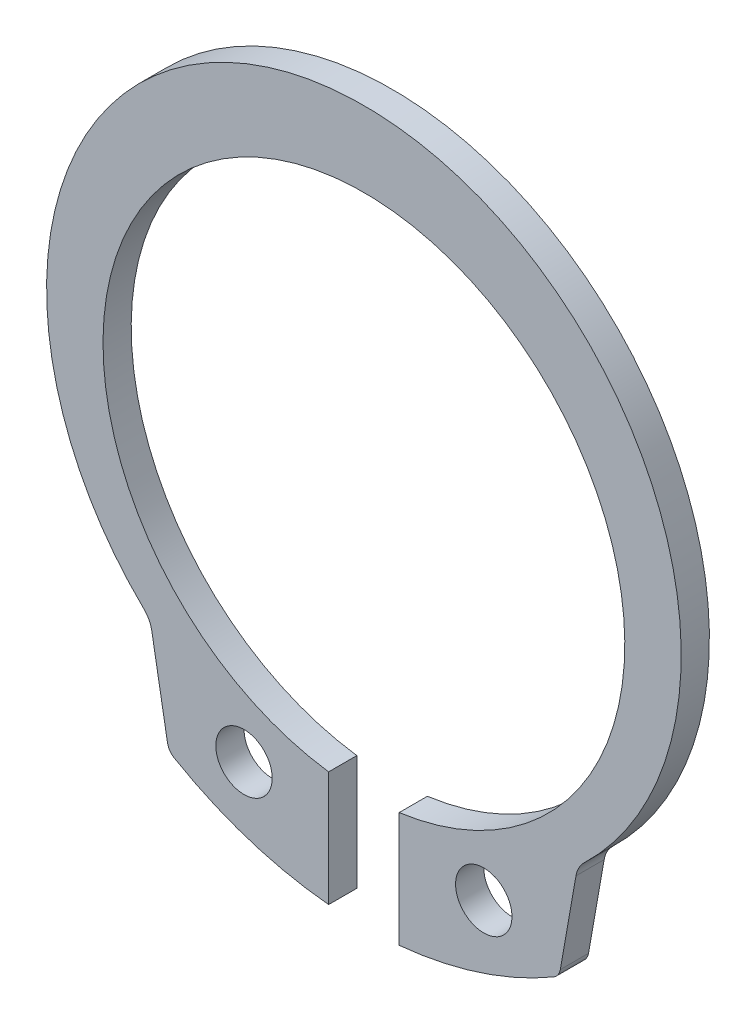
ISO-10303-21;
HEADER;
FILE_DESCRIPTION(('STEP AP214'),'2;1');
FILE_NAME('part.step','',(''),(''),'','','');
FILE_SCHEMA(('AUTOMOTIVE_DESIGN { 1 0 10303 214 1 1 1 1 }'));
ENDSEC;
DATA;
#1=APPLICATION_CONTEXT('core data for automotive mechanical design processes');
#2=APPLICATION_PROTOCOL_DEFINITION('international standard','automotive_design',2000,#1);
#3=PRODUCT_CONTEXT('',#1,'mechanical');
#4=PRODUCT('Part','Part','',(#3));
#5=PRODUCT_RELATED_PRODUCT_CATEGORY('part','',(#4));
#6=PRODUCT_DEFINITION_FORMATION('','',#4);
#7=PRODUCT_DEFINITION_CONTEXT('part definition',#1,'design');
#8=PRODUCT_DEFINITION('design','',#6,#7);
#9=PRODUCT_DEFINITION_SHAPE('','',#8);
#10=(LENGTH_UNIT() NAMED_UNIT(*) SI_UNIT(.MILLI.,.METRE.));
#11=(NAMED_UNIT(*) PLANE_ANGLE_UNIT() SI_UNIT($,.RADIAN.));
#12=(NAMED_UNIT(*) SI_UNIT($,.STERADIAN.) SOLID_ANGLE_UNIT());
#13=UNCERTAINTY_MEASURE_WITH_UNIT(LENGTH_MEASURE(1.E-05),#10,'distance_accuracy_value','');
#14=(GEOMETRIC_REPRESENTATION_CONTEXT(3) GLOBAL_UNCERTAINTY_ASSIGNED_CONTEXT((#13)) GLOBAL_UNIT_ASSIGNED_CONTEXT((#10,
#11,#12)) REPRESENTATION_CONTEXT('',''));
#15=CARTESIAN_POINT('',(0.,0.,0.));
#16=DIRECTION('',(0.,0.,1.));
#17=DIRECTION('',(1.,0.,0.));
#18=AXIS2_PLACEMENT_3D('',#15,#16,#17);
#19=CARTESIAN_POINT('',(0.,-0.67,-1.));
#20=DIRECTION('',(0.,0.,1.));
#21=DIRECTION('',(1.,0.,0.));
#22=AXIS2_PLACEMENT_3D('',#19,#20,#21);
#23=CYLINDRICAL_SURFACE('',#22,13.3);
#24=CARTESIAN_POINT('',(0.,-0.67,-1.));
#25=DIRECTION('',(0.,0.,1.));
#26=DIRECTION('',(-1.,0.,0.));
#27=AXIS2_PLACEMENT_3D('',#24,#25,#26);
#28=CIRCLE('',#27,13.3);
#29=CARTESIAN_POINT('',(1.25,-13.9111291059335,-1.));
#30=VERTEX_POINT('',#29);
#31=CARTESIAN_POINT('',(6.72288210242388,-12.1457507918615,-1.));
#32=VERTEX_POINT('',#31);
#33=EDGE_CURVE('E174',#30,#32,#28,.T.);
#34=ORIENTED_EDGE('',*,*,#33,.T.);
#35=DIRECTION('',(0.,0.,1.));
#36=VECTOR('',#35,1.);
#37=CARTESIAN_POINT('',(6.72288210242388,-12.1457507918615,-1.));
#38=LINE('',#37,#36);
#39=CARTESIAN_POINT('',(6.72288210242388,-12.1457507918615,0.));
#40=VERTEX_POINT('',#39);
#41=EDGE_CURVE('E192',#32,#40,#38,.T.);
#42=ORIENTED_EDGE('',*,*,#41,.T.);
#43=CARTESIAN_POINT('',(0.,-0.67,0.));
#44=DIRECTION('',(0.,0.,1.));
#45=DIRECTION('',(-1.,0.,0.));
#46=AXIS2_PLACEMENT_3D('',#43,#44,#45);
#47=CIRCLE('',#46,13.3);
#48=CARTESIAN_POINT('',(1.25,-13.9111291059335,0.));
#49=VERTEX_POINT('',#48);
#50=EDGE_CURVE('E154',#49,#40,#47,.T.);
#51=ORIENTED_EDGE('',*,*,#50,.F.);
#52=DIRECTION('',(0.,0.,1.));
#53=VECTOR('',#52,1.);
#54=CARTESIAN_POINT('',(1.25,-13.9111291059335,-1.));
#55=LINE('',#54,#53);
#56=EDGE_CURVE('E175',#30,#49,#55,.T.);
#57=ORIENTED_EDGE('',*,*,#56,.F.);
#58=EDGE_LOOP('',(#34,#42,#51,#57));
#59=FACE_BOUND('',#58,.T.);
#60=ADVANCED_FACE('F33',(#59),#23,.T.);
#61=CARTESIAN_POINT('',(1.25,-9.83515138991168,-1.));
#62=DIRECTION('',(-1.,0.,0.));
#63=DIRECTION('',(0.,-1.,0.));
#64=AXIS2_PLACEMENT_3D('',#61,#62,#63);
#65=PLANE('',#64);
#66=DIRECTION('',(0.,-1.,0.));
#67=VECTOR('',#66,1.);
#68=CARTESIAN_POINT('',(1.25,-9.83515138991168,0.));
#69=LINE('',#68,#67);
#70=CARTESIAN_POINT('',(1.25,-9.83515138991168,0.));
#71=VERTEX_POINT('',#70);
#72=EDGE_CURVE('E171',#71,#49,#69,.T.);
#73=ORIENTED_EDGE('',*,*,#72,.F.);
#74=DIRECTION('',(0.,0.,1.));
#75=VECTOR('',#74,1.);
#76=CARTESIAN_POINT('',(1.25,-9.83515138991168,-1.));
#77=LINE('',#76,#75);
#78=CARTESIAN_POINT('',(1.25,-9.83515138991168,-1.));
#79=VERTEX_POINT('',#78);
#80=EDGE_CURVE('E178',#79,#71,#77,.T.);
#81=ORIENTED_EDGE('',*,*,#80,.F.);
#82=DIRECTION('',(0.,-1.,0.));
#83=VECTOR('',#82,1.);
#84=CARTESIAN_POINT('',(1.25,-9.83515138991168,-1.));
#85=LINE('',#84,#83);
#86=EDGE_CURVE('E141',#79,#30,#85,.T.);
#87=ORIENTED_EDGE('',*,*,#86,.T.);
#88=ORIENTED_EDGE('',*,*,#56,.T.);
#89=EDGE_LOOP('',(#73,#81,#87,#88));
#90=FACE_BOUND('',#89,.T.);
#91=ADVANCED_FACE('F273',(#90),#65,.T.);
#92=CARTESIAN_POINT('',(0.,-0.67,-1.));
#93=DIRECTION('',(0.,0.,1.));
#94=DIRECTION('',(1.,0.,0.));
#95=AXIS2_PLACEMENT_3D('',#92,#93,#94);
#96=CYLINDRICAL_SURFACE('',#95,9.25);
#97=CARTESIAN_POINT('',(0.,-0.67,0.));
#98=DIRECTION('',(0.,0.,-1.));
#99=DIRECTION('',(1.,0.,0.));
#100=AXIS2_PLACEMENT_3D('',#97,#98,#99);
#101=CIRCLE('',#100,9.25);
#102=CARTESIAN_POINT('',(-1.25000000000001,-9.83515138991168,0.));
#103=VERTEX_POINT('',#102);
#104=EDGE_CURVE('E168',#103,#71,#101,.T.);
#105=ORIENTED_EDGE('',*,*,#104,.F.);
#106=DIRECTION('',(0.,0.,1.));
#107=VECTOR('',#106,1.);
#108=CARTESIAN_POINT('',(-1.25000000000001,-9.83515138991168,-1.));
#109=LINE('',#108,#107);
#110=CARTESIAN_POINT('',(-1.25000000000001,-9.83515138991168,-1.));
#111=VERTEX_POINT('',#110);
#112=EDGE_CURVE('E140',#111,#103,#109,.T.);
#113=ORIENTED_EDGE('',*,*,#112,.F.);
#114=CARTESIAN_POINT('',(0.,-0.67,-1.));
#115=DIRECTION('',(0.,0.,-1.));
#116=DIRECTION('',(1.,0.,0.));
#117=AXIS2_PLACEMENT_3D('',#114,#115,#116);
#118=CIRCLE('',#117,9.25);
#119=EDGE_CURVE('E147',#111,#79,#118,.T.);
#120=ORIENTED_EDGE('',*,*,#119,.T.);
#121=ORIENTED_EDGE('',*,*,#80,.T.);
#122=EDGE_LOOP('',(#105,#113,#120,#121));
#123=FACE_BOUND('',#122,.T.);
#124=ADVANCED_FACE('F279',(#123),#96,.F.);
#125=CARTESIAN_POINT('',(-1.25,-9.83515138991168,-1.));
#126=DIRECTION('',(1.,0.,0.));
#127=DIRECTION('',(0.,1.,0.));
#128=AXIS2_PLACEMENT_3D('',#125,#126,#127);
#129=PLANE('',#128);
#130=DIRECTION('',(0.,1.,0.));
#131=VECTOR('',#130,1.);
#132=CARTESIAN_POINT('',(-1.25,-9.83515138991168,0.));
#133=LINE('',#132,#131);
#134=CARTESIAN_POINT('',(-1.25,-13.9111291059335,0.));
#135=VERTEX_POINT('',#134);
#136=EDGE_CURVE('E139',#135,#103,#133,.T.);
#137=ORIENTED_EDGE('',*,*,#136,.F.);
#138=DIRECTION('',(0.,0.,1.));
#139=VECTOR('',#138,1.);
#140=CARTESIAN_POINT('',(-1.25,-13.9111291059335,-1.));
#141=LINE('',#140,#139);
#142=CARTESIAN_POINT('',(-1.25,-13.9111291059335,-1.));
#143=VERTEX_POINT('',#142);
#144=EDGE_CURVE('E124',#143,#135,#141,.T.);
#145=ORIENTED_EDGE('',*,*,#144,.F.);
#146=DIRECTION('',(0.,1.,0.));
#147=VECTOR('',#146,1.);
#148=CARTESIAN_POINT('',(-1.25,-9.83515138991168,-1.));
#149=LINE('',#148,#147);
#150=EDGE_CURVE('E132',#143,#111,#149,.T.);
#151=ORIENTED_EDGE('',*,*,#150,.T.);
#152=ORIENTED_EDGE('',*,*,#112,.T.);
#153=EDGE_LOOP('',(#137,#145,#151,#152));
#154=FACE_BOUND('',#153,.T.);
#155=ADVANCED_FACE('F137',(#154),#129,.T.);
#156=CARTESIAN_POINT('',(0.,-0.67,-1.));
#157=DIRECTION('',(0.,0.,1.));
#158=DIRECTION('',(1.,0.,0.));
#159=AXIS2_PLACEMENT_3D('',#156,#157,#158);
#160=CYLINDRICAL_SURFACE('',#159,13.3);
#161=CARTESIAN_POINT('',(0.,-0.67,0.));
#162=DIRECTION('',(0.,0.,1.));
#163=DIRECTION('',(1.,0.,0.));
#164=AXIS2_PLACEMENT_3D('',#161,#162,#163);
#165=CIRCLE('',#164,13.3);
#166=CARTESIAN_POINT('',(-6.72288210242388,-12.1457507918615,0.));
#167=VERTEX_POINT('',#166);
#168=EDGE_CURVE('E165',#167,#135,#165,.T.);
#169=ORIENTED_EDGE('',*,*,#168,.F.);
#170=DIRECTION('',(0.,0.,1.));
#171=VECTOR('',#170,1.);
#172=CARTESIAN_POINT('',(-6.72288210242388,-12.1457507918615,-1.));
#173=LINE('',#172,#171);
#174=CARTESIAN_POINT('',(-6.72288210242388,-12.1457507918615,-1.));
#175=VERTEX_POINT('',#174);
#176=EDGE_CURVE('E127',#167,#175,#173,.F.);
#177=ORIENTED_EDGE('',*,*,#176,.T.);
#178=CARTESIAN_POINT('',(0.,-0.67,-1.));
#179=DIRECTION('',(0.,0.,1.));
#180=DIRECTION('',(1.,0.,0.));
#181=AXIS2_PLACEMENT_3D('',#178,#179,#180);
#182=CIRCLE('',#181,13.3);
#183=EDGE_CURVE('E120',#175,#143,#182,.T.);
#184=ORIENTED_EDGE('',*,*,#183,.T.);
#185=ORIENTED_EDGE('',*,*,#144,.T.);
#186=EDGE_LOOP('',(#169,#177,#184,#185));
#187=FACE_BOUND('',#186,.T.);
#188=ADVANCED_FACE('F123',(#187),#160,.T.);
#189=CARTESIAN_POINT('',(-7.57714113219204,-8.31561376344786,-1.));
#190=DIRECTION('',(-0.984807753012208,-0.173648177666931,0.));
#191=DIRECTION('',(0.173648177666931,-0.984807753012208,0.));
#192=AXIS2_PLACEMENT_3D('',#189,#190,#191);
#193=PLANE('',#192);
#194=DIRECTION('',(0.173648177666931,-0.984807753012208,0.));
#195=VECTOR('',#194,1.);
#196=CARTESIAN_POINT('',(-7.57714113219204,-8.31561376344786,0.));
#197=LINE('',#196,#195);
#198=CARTESIAN_POINT('',(-7.51932463958032,-8.6435073868708,0.));
#199=VERTEX_POINT('',#198);
#200=CARTESIAN_POINT('',(-6.96254605026743,-11.8011556779934,0.));
#201=VERTEX_POINT('',#200);
#202=EDGE_CURVE('E163',#199,#201,#197,.T.);
#203=ORIENTED_EDGE('',*,*,#202,.F.);
#204=DIRECTION('',(0.,0.,-1.));
#205=VECTOR('',#204,1.);
#206=CARTESIAN_POINT('',(-7.51932463958032,-8.6435073868708,-1.));
#207=LINE('',#206,#205);
#208=CARTESIAN_POINT('',(-7.51932463958032,-8.6435073868708,-1.));
#209=VERTEX_POINT('',#208);
#210=EDGE_CURVE('E54',#199,#209,#207,.T.);
#211=ORIENTED_EDGE('',*,*,#210,.T.);
#212=DIRECTION('',(0.173648177666931,-0.984807753012208,0.));
#213=VECTOR('',#212,1.);
#214=CARTESIAN_POINT('',(-7.57714113219204,-8.31561376344786,-1.));
#215=LINE('',#214,#213);
#216=CARTESIAN_POINT('',(-6.96254605026743,-11.8011556779934,-1.));
#217=VERTEX_POINT('',#216);
#218=EDGE_CURVE('E133',#209,#217,#215,.T.);
#219=ORIENTED_EDGE('',*,*,#218,.T.);
#220=DIRECTION('',(0.,0.,1.));
#221=VECTOR('',#220,1.);
#222=CARTESIAN_POINT('',(-6.96254605026743,-11.8011556779934,-1.));
#223=LINE('',#222,#221);
#224=EDGE_CURVE('E177',#217,#201,#223,.T.);
#225=ORIENTED_EDGE('',*,*,#224,.T.);
#226=EDGE_LOOP('',(#203,#211,#219,#225));
#227=FACE_BOUND('',#226,.T.);
#228=ADVANCED_FACE('F332',(#227),#193,.T.);
#229=CARTESIAN_POINT('',(0.,0.,-1.));
#230=DIRECTION('',(0.,0.,1.));
#231=DIRECTION('',(1.,0.,0.));
#232=AXIS2_PLACEMENT_3D('',#229,#230,#231);
#233=CYLINDRICAL_SURFACE('',#232,11.25);
#234=CARTESIAN_POINT('',(0.,0.,0.));
#235=DIRECTION('',(0.,0.,1.));
#236=DIRECTION('',(1.,0.,0.));
#237=AXIS2_PLACEMENT_3D('',#234,#235,#236);
#238=CIRCLE('',#237,11.25);
#239=CARTESIAN_POINT('',(7.8099175034013,-8.09738776335097,0.));
#240=VERTEX_POINT('',#239);
#241=CARTESIAN_POINT('',(-7.8099175034013,-8.09738776335097,0.));
#242=VERTEX_POINT('',#241);
#243=EDGE_CURVE('E161',#240,#242,#238,.T.);
#244=ORIENTED_EDGE('',*,*,#243,.F.);
#245=DIRECTION('',(0.,0.,1.));
#246=VECTOR('',#245,1.);
#247=CARTESIAN_POINT('',(7.8099175034013,-8.09738776335097,-1.));
#248=LINE('',#247,#246);
#249=CARTESIAN_POINT('',(7.8099175034013,-8.09738776335097,-1.));
#250=VERTEX_POINT('',#249);
#251=EDGE_CURVE('E203',#240,#250,#248,.F.);
#252=ORIENTED_EDGE('',*,*,#251,.T.);
#253=CARTESIAN_POINT('',(0.,0.,-1.));
#254=DIRECTION('',(0.,0.,1.));
#255=DIRECTION('',(1.,0.,0.));
#256=AXIS2_PLACEMENT_3D('',#253,#254,#255);
#257=CIRCLE('',#256,11.25);
#258=CARTESIAN_POINT('',(-7.8099175034013,-8.09738776335097,-1.));
#259=VERTEX_POINT('',#258);
#260=EDGE_CURVE('E216',#250,#259,#257,.T.);
#261=ORIENTED_EDGE('',*,*,#260,.T.);
#262=DIRECTION('',(0.,0.,1.));
#263=VECTOR('',#262,1.);
#264=CARTESIAN_POINT('',(-7.8099175034013,-8.09738776335097,-1.));
#265=LINE('',#264,#263);
#266=EDGE_CURVE('E200',#259,#242,#265,.T.);
#267=ORIENTED_EDGE('',*,*,#266,.T.);
#268=EDGE_LOOP('',(#244,#252,#261,#267));
#269=FACE_BOUND('',#268,.T.);
#270=ADVANCED_FACE('F229',(#269),#233,.T.);
#271=CARTESIAN_POINT('',(7.57714113219204,-8.31561376344786,-1.));
#272=DIRECTION('',(0.984807753012208,-0.173648177666931,0.));
#273=DIRECTION('',(0.173648177666931,0.984807753012208,0.));
#274=AXIS2_PLACEMENT_3D('',#271,#272,#273);
#275=PLANE('',#274);
#276=DIRECTION('',(0.173648177666931,0.984807753012208,0.));
#277=VECTOR('',#276,1.);
#278=CARTESIAN_POINT('',(7.57714113219204,-8.31561376344786,-1.));
#279=LINE('',#278,#277);
#280=CARTESIAN_POINT('',(6.96254605026743,-11.8011556779934,-1.));
#281=VERTEX_POINT('',#280);
#282=CARTESIAN_POINT('',(7.51932463958032,-8.6435073868708,-1.));
#283=VERTEX_POINT('',#282);
#284=EDGE_CURVE('E213',#281,#283,#279,.T.);
#285=ORIENTED_EDGE('',*,*,#284,.T.);
#286=DIRECTION('',(0.,0.,-1.));
#287=VECTOR('',#286,1.);
#288=CARTESIAN_POINT('',(7.51932463958032,-8.6435073868708,0.));
#289=LINE('',#288,#287);
#290=CARTESIAN_POINT('',(7.51932463958032,-8.6435073868708,0.));
#291=VERTEX_POINT('',#290);
#292=EDGE_CURVE('E197',#283,#291,#289,.F.);
#293=ORIENTED_EDGE('',*,*,#292,.T.);
#294=DIRECTION('',(0.173648177666931,0.984807753012208,0.));
#295=VECTOR('',#294,1.);
#296=CARTESIAN_POINT('',(7.57714113219204,-8.31561376344786,0.));
#297=LINE('',#296,#295);
#298=CARTESIAN_POINT('',(6.96254605026743,-11.8011556779934,0.));
#299=VERTEX_POINT('',#298);
#300=EDGE_CURVE('E157',#299,#291,#297,.T.);
#301=ORIENTED_EDGE('',*,*,#300,.F.);
#302=DIRECTION('',(0.,0.,1.));
#303=VECTOR('',#302,1.);
#304=CARTESIAN_POINT('',(6.96254605026743,-11.8011556779934,-1.));
#305=LINE('',#304,#303);
#306=EDGE_CURVE('E195',#299,#281,#305,.F.);
#307=ORIENTED_EDGE('',*,*,#306,.T.);
#308=EDGE_LOOP('',(#285,#293,#301,#307));
#309=FACE_BOUND('',#308,.T.);
#310=ADVANCED_FACE('F221',(#309),#275,.T.);
#311=CARTESIAN_POINT('',(0.,-0.67,-1.));
#312=DIRECTION('',(0.,0.,-1.));
#313=DIRECTION('',(-1.,0.,0.));
#314=AXIS2_PLACEMENT_3D('',#311,#312,#313);
#315=PLANE('',#314);
#316=CARTESIAN_POINT('',(4.25,-11.0323115181894,-1.));
#317=DIRECTION('',(0.,0.,1.));
#318=DIRECTION('',(-1.,0.,0.));
#319=AXIS2_PLACEMENT_3D('',#316,#317,#318);
#320=CIRCLE('',#319,1.);
#321=CARTESIAN_POINT('',(3.25,-11.0323115181894,-1.));
#322=VERTEX_POINT('',#321);
#323=EDGE_CURVE('E241',#322,#322,#320,.T.);
#324=ORIENTED_EDGE('',*,*,#323,.T.);
#325=EDGE_LOOP('',(#324));
#326=FACE_BOUND('',#325,.T.);
#327=CARTESIAN_POINT('',(-4.25,-11.0323115181894,-1.));
#328=DIRECTION('',(0.,0.,1.));
#329=DIRECTION('',(1.,0.,0.));
#330=AXIS2_PLACEMENT_3D('',#327,#328,#329);
#331=CIRCLE('',#330,1.);
#332=CARTESIAN_POINT('',(-3.25,-11.0323115181894,-1.));
#333=VERTEX_POINT('',#332);
#334=EDGE_CURVE('E158',#333,#333,#331,.T.);
#335=ORIENTED_EDGE('',*,*,#334,.T.);
#336=EDGE_LOOP('',(#335));
#337=FACE_BOUND('',#336,.T.);
#338=ORIENTED_EDGE('',*,*,#183,.F.);
#339=CARTESIAN_POINT('',(-6.47014217376132,-11.7143315891599,-1.));
#340=DIRECTION('',(0.,0.,-1.));
#341=DIRECTION('',(-1.,0.,0.));
#342=AXIS2_PLACEMENT_3D('',#339,#340,#341);
#343=CIRCLE('',#342,0.5);
#344=EDGE_CURVE('E190',#175,#217,#343,.T.);
#345=ORIENTED_EDGE('',*,*,#344,.T.);
#346=ORIENTED_EDGE('',*,*,#218,.F.);
#347=CARTESIAN_POINT('',(-8.50413239259252,-8.81715556453773,-1.));
#348=DIRECTION('',(0.,0.,-1.));
#349=DIRECTION('',(-1.,0.,0.));
#350=AXIS2_PLACEMENT_3D('',#347,#348,#349);
#351=CIRCLE('',#350,1.);
#352=EDGE_CURVE('E11',#209,#259,#351,.F.);
#353=ORIENTED_EDGE('',*,*,#352,.T.);
#354=ORIENTED_EDGE('',*,*,#260,.F.);
#355=CARTESIAN_POINT('',(8.50413239259252,-8.81715556453773,-1.));
#356=DIRECTION('',(0.,0.,-1.));
#357=DIRECTION('',(-1.,0.,0.));
#358=AXIS2_PLACEMENT_3D('',#355,#356,#357);
#359=CIRCLE('',#358,1.);
#360=EDGE_CURVE('E208',#250,#283,#359,.F.);
#361=ORIENTED_EDGE('',*,*,#360,.T.);
#362=ORIENTED_EDGE('',*,*,#284,.F.);
#363=CARTESIAN_POINT('',(6.47014217376132,-11.7143315891599,-1.));
#364=DIRECTION('',(0.,0.,-1.));
#365=DIRECTION('',(-1.,0.,0.));
#366=AXIS2_PLACEMENT_3D('',#363,#364,#365);
#367=CIRCLE('',#366,0.5);
#368=EDGE_CURVE('E188',#281,#32,#367,.T.);
#369=ORIENTED_EDGE('',*,*,#368,.T.);
#370=ORIENTED_EDGE('',*,*,#33,.F.);
#371=ORIENTED_EDGE('',*,*,#86,.F.);
#372=ORIENTED_EDGE('',*,*,#119,.F.);
#373=ORIENTED_EDGE('',*,*,#150,.F.);
#374=EDGE_LOOP('',(#338,#345,#346,#353,#354,#361,#362,#369,#370,#371,#372,#373));
#375=FACE_BOUND('',#374,.T.);
#376=ADVANCED_FACE('F144',(#326,#337,#375),#315,.T.);
#377=CARTESIAN_POINT('',(0.,-0.67,0.));
#378=DIRECTION('',(0.,0.,-1.));
#379=DIRECTION('',(-1.,0.,0.));
#380=AXIS2_PLACEMENT_3D('',#377,#378,#379);
#381=PLANE('',#380);
#382=CARTESIAN_POINT('',(4.25,-11.0323115181894,0.));
#383=DIRECTION('',(0.,0.,1.));
#384=DIRECTION('',(-1.,0.,0.));
#385=AXIS2_PLACEMENT_3D('',#382,#383,#384);
#386=CIRCLE('',#385,1.);
#387=CARTESIAN_POINT('',(3.25,-11.0323115181894,0.));
#388=VERTEX_POINT('',#387);
#389=EDGE_CURVE('E244',#388,#388,#386,.T.);
#390=ORIENTED_EDGE('',*,*,#389,.F.);
#391=EDGE_LOOP('',(#390));
#392=FACE_BOUND('',#391,.T.);
#393=CARTESIAN_POINT('',(-4.25,-11.0323115181894,0.));
#394=DIRECTION('',(0.,0.,1.));
#395=DIRECTION('',(1.,0.,0.));
#396=AXIS2_PLACEMENT_3D('',#393,#394,#395);
#397=CIRCLE('',#396,1.);
#398=CARTESIAN_POINT('',(-3.25,-11.0323115181894,0.));
#399=VERTEX_POINT('',#398);
#400=EDGE_CURVE('E238',#399,#399,#397,.T.);
#401=ORIENTED_EDGE('',*,*,#400,.F.);
#402=EDGE_LOOP('',(#401));
#403=FACE_BOUND('',#402,.T.);
#404=ORIENTED_EDGE('',*,*,#243,.T.);
#405=CARTESIAN_POINT('',(-8.50413239259252,-8.81715556453773,0.));
#406=DIRECTION('',(0.,0.,-1.));
#407=DIRECTION('',(-1.,0.,0.));
#408=AXIS2_PLACEMENT_3D('',#405,#406,#407);
#409=CIRCLE('',#408,1.);
#410=EDGE_CURVE('E41',#242,#199,#409,.T.);
#411=ORIENTED_EDGE('',*,*,#410,.T.);
#412=ORIENTED_EDGE('',*,*,#202,.T.);
#413=CARTESIAN_POINT('',(-6.47014217376132,-11.7143315891599,0.));
#414=DIRECTION('',(0.,0.,-1.));
#415=DIRECTION('',(-1.,0.,0.));
#416=AXIS2_PLACEMENT_3D('',#413,#414,#415);
#417=CIRCLE('',#416,0.5);
#418=EDGE_CURVE('E185',#201,#167,#417,.F.);
#419=ORIENTED_EDGE('',*,*,#418,.T.);
#420=ORIENTED_EDGE('',*,*,#168,.T.);
#421=ORIENTED_EDGE('',*,*,#136,.T.);
#422=ORIENTED_EDGE('',*,*,#104,.T.);
#423=ORIENTED_EDGE('',*,*,#72,.T.);
#424=ORIENTED_EDGE('',*,*,#50,.T.);
#425=CARTESIAN_POINT('',(6.47014217376132,-11.7143315891599,0.));
#426=DIRECTION('',(0.,0.,-1.));
#427=DIRECTION('',(-1.,0.,0.));
#428=AXIS2_PLACEMENT_3D('',#425,#426,#427);
#429=CIRCLE('',#428,0.5);
#430=EDGE_CURVE('E183',#40,#299,#429,.F.);
#431=ORIENTED_EDGE('',*,*,#430,.T.);
#432=ORIENTED_EDGE('',*,*,#300,.T.);
#433=CARTESIAN_POINT('',(8.50413239259252,-8.81715556453773,0.));
#434=DIRECTION('',(0.,0.,-1.));
#435=DIRECTION('',(-1.,0.,0.));
#436=AXIS2_PLACEMENT_3D('',#433,#434,#435);
#437=CIRCLE('',#436,1.);
#438=EDGE_CURVE('E206',#291,#240,#437,.T.);
#439=ORIENTED_EDGE('',*,*,#438,.T.);
#440=EDGE_LOOP('',(#404,#411,#412,#419,#420,#421,#422,#423,#424,#431,#432,#439));
#441=FACE_BOUND('',#440,.T.);
#442=ADVANCED_FACE('F227',(#392,#403,#441),#381,.F.);
#443=CARTESIAN_POINT('',(-4.25,-11.0323115181894,-1.));
#444=DIRECTION('',(0.,0.,1.));
#445=DIRECTION('',(1.,0.,0.));
#446=AXIS2_PLACEMENT_3D('',#443,#444,#445);
#447=CYLINDRICAL_SURFACE('',#446,1.);
#448=ORIENTED_EDGE('',*,*,#334,.F.);
#449=EDGE_LOOP('',(#448));
#450=FACE_BOUND('',#449,.T.);
#451=ORIENTED_EDGE('',*,*,#400,.T.);
#452=EDGE_LOOP('',(#451));
#453=FACE_BOUND('',#452,.T.);
#454=ADVANCED_FACE('F256',(#450,#453),#447,.F.);
#455=CARTESIAN_POINT('',(4.25,-11.0323115181894,-1.));
#456=DIRECTION('',(0.,0.,1.));
#457=DIRECTION('',(1.,0.,0.));
#458=AXIS2_PLACEMENT_3D('',#455,#456,#457);
#459=CYLINDRICAL_SURFACE('',#458,1.);
#460=ORIENTED_EDGE('',*,*,#323,.F.);
#461=EDGE_LOOP('',(#460));
#462=FACE_BOUND('',#461,.T.);
#463=ORIENTED_EDGE('',*,*,#389,.T.);
#464=EDGE_LOOP('',(#463));
#465=FACE_BOUND('',#464,.T.);
#466=ADVANCED_FACE('F252',(#462,#465),#459,.F.);
#467=CARTESIAN_POINT('',(-6.47014217376132,-11.7143315891599,-1.));
#468=DIRECTION('',(0.,0.,1.));
#469=DIRECTION('',(1.,0.,0.));
#470=AXIS2_PLACEMENT_3D('',#467,#468,#469);
#471=CYLINDRICAL_SURFACE('',#470,0.5);
#472=ORIENTED_EDGE('',*,*,#344,.F.);
#473=ORIENTED_EDGE('',*,*,#176,.F.);
#474=ORIENTED_EDGE('',*,*,#418,.F.);
#475=ORIENTED_EDGE('',*,*,#224,.F.);
#476=EDGE_LOOP('',(#472,#473,#474,#475));
#477=FACE_BOUND('',#476,.T.);
#478=ADVANCED_FACE('F255',(#477),#471,.T.);
#479=CARTESIAN_POINT('',(6.47014217376132,-11.7143315891599,-1.));
#480=DIRECTION('',(0.,0.,1.));
#481=DIRECTION('',(1.,0.,0.));
#482=AXIS2_PLACEMENT_3D('',#479,#480,#481);
#483=CYLINDRICAL_SURFACE('',#482,0.5);
#484=ORIENTED_EDGE('',*,*,#368,.F.);
#485=ORIENTED_EDGE('',*,*,#306,.F.);
#486=ORIENTED_EDGE('',*,*,#430,.F.);
#487=ORIENTED_EDGE('',*,*,#41,.F.);
#488=EDGE_LOOP('',(#484,#485,#486,#487));
#489=FACE_BOUND('',#488,.T.);
#490=ADVANCED_FACE('F287',(#489),#483,.T.);
#491=CARTESIAN_POINT('',(8.50413239259252,-8.81715556453773,-1.));
#492=DIRECTION('',(0.,0.,1.));
#493=DIRECTION('',(1.,0.,0.));
#494=AXIS2_PLACEMENT_3D('',#491,#492,#493);
#495=CYLINDRICAL_SURFACE('',#494,1.);
#496=ORIENTED_EDGE('',*,*,#360,.F.);
#497=ORIENTED_EDGE('',*,*,#251,.F.);
#498=ORIENTED_EDGE('',*,*,#438,.F.);
#499=ORIENTED_EDGE('',*,*,#292,.F.);
#500=EDGE_LOOP('',(#496,#497,#498,#499));
#501=FACE_BOUND('',#500,.T.);
#502=ADVANCED_FACE('F225',(#501),#495,.F.);
#503=CARTESIAN_POINT('',(-8.50413239259252,-8.81715556453773,-1.));
#504=DIRECTION('',(0.,0.,1.));
#505=DIRECTION('',(1.,0.,0.));
#506=AXIS2_PLACEMENT_3D('',#503,#504,#505);
#507=CYLINDRICAL_SURFACE('',#506,1.);
#508=ORIENTED_EDGE('',*,*,#352,.F.);
#509=ORIENTED_EDGE('',*,*,#210,.F.);
#510=ORIENTED_EDGE('',*,*,#410,.F.);
#511=ORIENTED_EDGE('',*,*,#266,.F.);
#512=EDGE_LOOP('',(#508,#509,#510,#511));
#513=FACE_BOUND('',#512,.T.);
#514=ADVANCED_FACE('F35',(#513),#507,.F.);
#515=CLOSED_SHELL('',(#60,#91,#124,#155,#188,#228,#270,#310,#376,#442,#454,#466,#478,#490,#502,#514));
#516=MANIFOLD_SOLID_BREP('B2',#515);
#517=ADVANCED_BREP_SHAPE_REPRESENTATION('',(#18,#516),#14);
#518=SHAPE_DEFINITION_REPRESENTATION(#9,#517);
ENDSEC;
END-ISO-10303-21;
